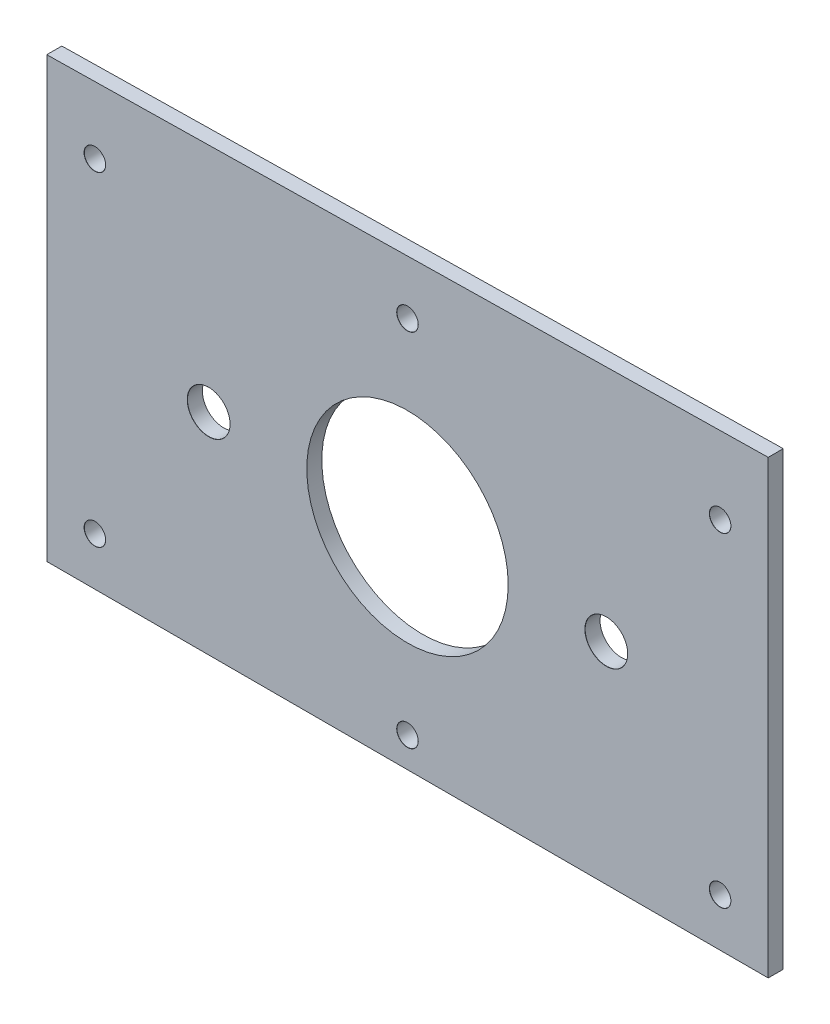
ISO-10303-21;
HEADER;
FILE_DESCRIPTION(('STEP AP214'),'2;1');
FILE_NAME('part.step','',(''),(''),'','','');
FILE_SCHEMA(('AUTOMOTIVE_DESIGN { 1 0 10303 214 1 1 1 1 }'));
ENDSEC;
DATA;
#1=APPLICATION_CONTEXT('core data for automotive mechanical design processes');
#2=APPLICATION_PROTOCOL_DEFINITION('international standard','automotive_design',2000,#1);
#3=PRODUCT_CONTEXT('',#1,'mechanical');
#4=PRODUCT('Part','Part','',(#3));
#5=PRODUCT_RELATED_PRODUCT_CATEGORY('part','',(#4));
#6=PRODUCT_DEFINITION_FORMATION('','',#4);
#7=PRODUCT_DEFINITION_CONTEXT('part definition',#1,'design');
#8=PRODUCT_DEFINITION('design','',#6,#7);
#9=PRODUCT_DEFINITION_SHAPE('','',#8);
#10=(LENGTH_UNIT() NAMED_UNIT(*) SI_UNIT(.MILLI.,.METRE.));
#11=(NAMED_UNIT(*) PLANE_ANGLE_UNIT() SI_UNIT($,.RADIAN.));
#12=(NAMED_UNIT(*) SI_UNIT($,.STERADIAN.) SOLID_ANGLE_UNIT());
#13=UNCERTAINTY_MEASURE_WITH_UNIT(LENGTH_MEASURE(1.E-05),#10,'distance_accuracy_value','');
#14=(GEOMETRIC_REPRESENTATION_CONTEXT(3) GLOBAL_UNCERTAINTY_ASSIGNED_CONTEXT((#13)) GLOBAL_UNIT_ASSIGNED_CONTEXT((#10,
#11,#12)) REPRESENTATION_CONTEXT('',''));
#15=CARTESIAN_POINT('',(0.,0.,0.));
#16=DIRECTION('',(0.,0.,1.));
#17=DIRECTION('',(1.,0.,0.));
#18=AXIS2_PLACEMENT_3D('',#15,#16,#17);
#19=CARTESIAN_POINT('',(76.2,44.45,3.175));
#20=DIRECTION('',(-1.,0.,0.));
#21=DIRECTION('',(0.,0.,1.));
#22=AXIS2_PLACEMENT_3D('',#19,#20,#21);
#23=PLANE('',#22);
#24=DIRECTION('',(0.,1.,0.));
#25=VECTOR('',#24,1.);
#26=CARTESIAN_POINT('',(76.2,44.45,0.));
#27=LINE('',#26,#25);
#28=CARTESIAN_POINT('',(76.2,-44.45,0.));
#29=VERTEX_POINT('',#28);
#30=CARTESIAN_POINT('',(76.2,50.8,0.));
#31=VERTEX_POINT('',#30);
#32=EDGE_CURVE('E80',#29,#31,#27,.T.);
#33=ORIENTED_EDGE('',*,*,#32,.T.);
#34=DIRECTION('',(0.,0.,-1.));
#35=VECTOR('',#34,1.);
#36=CARTESIAN_POINT('',(76.2,50.8,3.175));
#37=LINE('',#36,#35);
#38=CARTESIAN_POINT('',(76.2,50.8,3.175));
#39=VERTEX_POINT('',#38);
#40=EDGE_CURVE('E11',#39,#31,#37,.T.);
#41=ORIENTED_EDGE('',*,*,#40,.F.);
#42=DIRECTION('',(0.,1.,0.));
#43=VECTOR('',#42,1.);
#44=CARTESIAN_POINT('',(76.2,44.45,3.175));
#45=LINE('',#44,#43);
#46=CARTESIAN_POINT('',(76.2,-44.45,3.175));
#47=VERTEX_POINT('',#46);
#48=EDGE_CURVE('E85',#47,#39,#45,.T.);
#49=ORIENTED_EDGE('',*,*,#48,.F.);
#50=DIRECTION('',(0.,0.,-1.));
#51=VECTOR('',#50,1.);
#52=CARTESIAN_POINT('',(76.2,-44.45,3.175));
#53=LINE('',#52,#51);
#54=EDGE_CURVE('E101',#47,#29,#53,.T.);
#55=ORIENTED_EDGE('',*,*,#54,.T.);
#56=EDGE_LOOP('',(#33,#41,#49,#55));
#57=FACE_BOUND('',#56,.T.);
#58=ADVANCED_FACE('F41',(#57),#23,.F.);
#59=CARTESIAN_POINT('',(-76.2,48.26,3.175));
#60=DIRECTION('',(0.0166643523339933,-0.9998611400396,0.));
#61=DIRECTION('',(0.9998611400396,0.0166643523339933,0.));
#62=AXIS2_PLACEMENT_3D('',#59,#60,#61);
#63=PLANE('',#62);
#64=DIRECTION('',(-0.9998611400396,-0.0166643523339933,0.));
#65=VECTOR('',#64,1.);
#66=CARTESIAN_POINT('',(-76.2,48.26,0.));
#67=LINE('',#66,#65);
#68=CARTESIAN_POINT('',(-76.2,48.26,0.));
#69=VERTEX_POINT('',#68);
#70=EDGE_CURVE('E97',#31,#69,#67,.T.);
#71=ORIENTED_EDGE('',*,*,#70,.T.);
#72=DIRECTION('',(0.,0.,-1.));
#73=VECTOR('',#72,1.);
#74=CARTESIAN_POINT('',(-76.2,48.26,3.175));
#75=LINE('',#74,#73);
#76=CARTESIAN_POINT('',(-76.2,48.26,3.175));
#77=VERTEX_POINT('',#76);
#78=EDGE_CURVE('E49',#77,#69,#75,.T.);
#79=ORIENTED_EDGE('',*,*,#78,.F.);
#80=DIRECTION('',(-0.9998611400396,-0.0166643523339933,0.));
#81=VECTOR('',#80,1.);
#82=CARTESIAN_POINT('',(-76.2,48.26,3.175));
#83=LINE('',#82,#81);
#84=EDGE_CURVE('E88',#39,#77,#83,.T.);
#85=ORIENTED_EDGE('',*,*,#84,.F.);
#86=ORIENTED_EDGE('',*,*,#40,.T.);
#87=EDGE_LOOP('',(#71,#79,#85,#86));
#88=FACE_BOUND('',#87,.T.);
#89=ADVANCED_FACE('F96',(#88),#63,.F.);
#90=CARTESIAN_POINT('',(-76.2,44.45,3.175));
#91=DIRECTION('',(1.,0.,0.));
#92=DIRECTION('',(0.,0.,-1.));
#93=AXIS2_PLACEMENT_3D('',#90,#91,#92);
#94=PLANE('',#93);
#95=DIRECTION('',(0.,-1.,0.));
#96=VECTOR('',#95,1.);
#97=CARTESIAN_POINT('',(-76.2,44.45,0.));
#98=LINE('',#97,#96);
#99=CARTESIAN_POINT('',(-76.2,-44.45,0.));
#100=VERTEX_POINT('',#99);
#101=EDGE_CURVE('E73',#69,#100,#98,.T.);
#102=ORIENTED_EDGE('',*,*,#101,.T.);
#103=DIRECTION('',(0.,0.,-1.));
#104=VECTOR('',#103,1.);
#105=CARTESIAN_POINT('',(-76.2,-44.45,3.175));
#106=LINE('',#105,#104);
#107=CARTESIAN_POINT('',(-76.2,-44.45,3.175));
#108=VERTEX_POINT('',#107);
#109=EDGE_CURVE('E98',#108,#100,#106,.T.);
#110=ORIENTED_EDGE('',*,*,#109,.F.);
#111=DIRECTION('',(0.,-1.,0.));
#112=VECTOR('',#111,1.);
#113=CARTESIAN_POINT('',(-76.2,48.26,3.175));
#114=LINE('',#113,#112);
#115=EDGE_CURVE('E92',#77,#108,#114,.T.);
#116=ORIENTED_EDGE('',*,*,#115,.F.);
#117=ORIENTED_EDGE('',*,*,#78,.T.);
#118=EDGE_LOOP('',(#102,#110,#116,#117));
#119=FACE_BOUND('',#118,.T.);
#120=ADVANCED_FACE('F99',(#119),#94,.F.);
#121=CARTESIAN_POINT('',(-76.2,-44.45,3.175));
#122=DIRECTION('',(0.,1.,0.));
#123=DIRECTION('',(0.,0.,1.));
#124=AXIS2_PLACEMENT_3D('',#121,#122,#123);
#125=PLANE('',#124);
#126=DIRECTION('',(1.,0.,0.));
#127=VECTOR('',#126,1.);
#128=CARTESIAN_POINT('',(-76.2,-44.45,0.));
#129=LINE('',#128,#127);
#130=EDGE_CURVE('E109',#100,#29,#129,.T.);
#131=ORIENTED_EDGE('',*,*,#130,.T.);
#132=ORIENTED_EDGE('',*,*,#54,.F.);
#133=DIRECTION('',(1.,0.,0.));
#134=VECTOR('',#133,1.);
#135=CARTESIAN_POINT('',(-76.2,-44.45,3.175));
#136=LINE('',#135,#134);
#137=EDGE_CURVE('E57',#108,#47,#136,.T.);
#138=ORIENTED_EDGE('',*,*,#137,.F.);
#139=ORIENTED_EDGE('',*,*,#109,.T.);
#140=EDGE_LOOP('',(#131,#132,#138,#139));
#141=FACE_BOUND('',#140,.T.);
#142=ADVANCED_FACE('F114',(#141),#125,.F.);
#143=CARTESIAN_POINT('',(0.,0.,3.175));
#144=DIRECTION('',(0.,0.,1.));
#145=DIRECTION('',(1.,0.,0.));
#146=AXIS2_PLACEMENT_3D('',#143,#144,#145);
#147=PLANE('',#146);
#148=CARTESIAN_POINT('',(0.,0.,3.175));
#149=DIRECTION('',(0.,0.,1.));
#150=DIRECTION('',(1.,0.,0.));
#151=AXIS2_PLACEMENT_3D('',#148,#149,#150);
#152=CIRCLE('',#151,21.275);
#153=CARTESIAN_POINT('',(21.275,0.,3.175));
#154=VERTEX_POINT('',#153);
#155=EDGE_CURVE('E210',#154,#154,#152,.T.);
#156=ORIENTED_EDGE('',*,*,#155,.F.);
#157=EDGE_LOOP('',(#156));
#158=FACE_BOUND('',#157,.T.);
#159=CARTESIAN_POINT('',(-42.,0.,3.175));
#160=DIRECTION('',(0.,0.,1.));
#161=DIRECTION('',(1.,0.,0.));
#162=AXIS2_PLACEMENT_3D('',#159,#160,#161);
#163=CIRCLE('',#162,4.525);
#164=CARTESIAN_POINT('',(-37.475,0.,3.175));
#165=VERTEX_POINT('',#164);
#166=EDGE_CURVE('E206',#165,#165,#163,.T.);
#167=ORIENTED_EDGE('',*,*,#166,.F.);
#168=EDGE_LOOP('',(#167));
#169=FACE_BOUND('',#168,.T.);
#170=CARTESIAN_POINT('',(42.,0.,3.175));
#171=DIRECTION('',(0.,0.,1.));
#172=DIRECTION('',(1.,0.,0.));
#173=AXIS2_PLACEMENT_3D('',#170,#171,#172);
#174=CIRCLE('',#173,4.525);
#175=CARTESIAN_POINT('',(46.525,0.,3.175));
#176=VERTEX_POINT('',#175);
#177=EDGE_CURVE('E197',#176,#176,#174,.T.);
#178=ORIENTED_EDGE('',*,*,#177,.F.);
#179=EDGE_LOOP('',(#178));
#180=FACE_BOUND('',#179,.T.);
#181=CARTESIAN_POINT('',(-66.04,34.29,3.175));
#182=DIRECTION('',(0.,0.,1.));
#183=DIRECTION('',(1.,0.,0.));
#184=AXIS2_PLACEMENT_3D('',#181,#182,#183);
#185=CIRCLE('',#184,2.275);
#186=CARTESIAN_POINT('',(-63.765,34.29,3.175));
#187=VERTEX_POINT('',#186);
#188=EDGE_CURVE('E188',#187,#187,#185,.T.);
#189=ORIENTED_EDGE('',*,*,#188,.F.);
#190=EDGE_LOOP('',(#189));
#191=FACE_BOUND('',#190,.T.);
#192=CARTESIAN_POINT('',(-66.04,-34.29,3.175));
#193=DIRECTION('',(0.,0.,1.));
#194=DIRECTION('',(1.,0.,0.));
#195=AXIS2_PLACEMENT_3D('',#192,#193,#194);
#196=CIRCLE('',#195,2.275);
#197=CARTESIAN_POINT('',(-63.765,-34.29,3.175));
#198=VERTEX_POINT('',#197);
#199=EDGE_CURVE('E179',#198,#198,#196,.T.);
#200=ORIENTED_EDGE('',*,*,#199,.F.);
#201=EDGE_LOOP('',(#200));
#202=FACE_BOUND('',#201,.T.);
#203=CARTESIAN_POINT('',(0.,-38.1,3.175));
#204=DIRECTION('',(0.,0.,1.));
#205=DIRECTION('',(1.,0.,0.));
#206=AXIS2_PLACEMENT_3D('',#203,#204,#205);
#207=CIRCLE('',#206,2.275);
#208=CARTESIAN_POINT('',(2.27500000000003,-38.1,3.175));
#209=VERTEX_POINT('',#208);
#210=EDGE_CURVE('E170',#209,#209,#207,.T.);
#211=ORIENTED_EDGE('',*,*,#210,.F.);
#212=EDGE_LOOP('',(#211));
#213=FACE_BOUND('',#212,.T.);
#214=CARTESIAN_POINT('',(66.04,-34.29,3.175));
#215=DIRECTION('',(0.,0.,1.));
#216=DIRECTION('',(1.,0.,0.));
#217=AXIS2_PLACEMENT_3D('',#214,#215,#216);
#218=CIRCLE('',#217,2.275);
#219=CARTESIAN_POINT('',(68.315,-34.29,3.175));
#220=VERTEX_POINT('',#219);
#221=EDGE_CURVE('E161',#220,#220,#218,.T.);
#222=ORIENTED_EDGE('',*,*,#221,.F.);
#223=EDGE_LOOP('',(#222));
#224=FACE_BOUND('',#223,.T.);
#225=CARTESIAN_POINT('',(66.04,34.29,3.175));
#226=DIRECTION('',(0.,0.,1.));
#227=DIRECTION('',(1.,0.,0.));
#228=AXIS2_PLACEMENT_3D('',#225,#226,#227);
#229=CIRCLE('',#228,2.275);
#230=CARTESIAN_POINT('',(68.315,34.29,3.175));
#231=VERTEX_POINT('',#230);
#232=EDGE_CURVE('E152',#231,#231,#229,.T.);
#233=ORIENTED_EDGE('',*,*,#232,.F.);
#234=EDGE_LOOP('',(#233));
#235=FACE_BOUND('',#234,.T.);
#236=CARTESIAN_POINT('',(0.,38.1,3.175));
#237=DIRECTION('',(0.,0.,1.));
#238=DIRECTION('',(1.,0.,0.));
#239=AXIS2_PLACEMENT_3D('',#236,#237,#238);
#240=CIRCLE('',#239,2.275);
#241=CARTESIAN_POINT('',(2.27500000000003,38.1,3.175));
#242=VERTEX_POINT('',#241);
#243=EDGE_CURVE('E143',#242,#242,#240,.T.);
#244=ORIENTED_EDGE('',*,*,#243,.F.);
#245=EDGE_LOOP('',(#244));
#246=FACE_BOUND('',#245,.T.);
#247=ORIENTED_EDGE('',*,*,#48,.T.);
#248=ORIENTED_EDGE('',*,*,#84,.T.);
#249=ORIENTED_EDGE('',*,*,#115,.T.);
#250=ORIENTED_EDGE('',*,*,#137,.T.);
#251=EDGE_LOOP('',(#247,#248,#249,#250));
#252=FACE_BOUND('',#251,.T.);
#253=ADVANCED_FACE('F90',(#158,#169,#180,#191,#202,#213,#224,#235,#246,#252),#147,.T.);
#254=CARTESIAN_POINT('',(0.,0.,0.));
#255=DIRECTION('',(0.,0.,1.));
#256=DIRECTION('',(1.,0.,0.));
#257=AXIS2_PLACEMENT_3D('',#254,#255,#256);
#258=PLANE('',#257);
#259=CARTESIAN_POINT('',(0.,0.,0.));
#260=DIRECTION('',(0.,0.,1.));
#261=DIRECTION('',(1.,0.,0.));
#262=AXIS2_PLACEMENT_3D('',#259,#260,#261);
#263=CIRCLE('',#262,21.275);
#264=CARTESIAN_POINT('',(21.275,0.,0.));
#265=VERTEX_POINT('',#264);
#266=EDGE_CURVE('E209',#265,#265,#263,.T.);
#267=ORIENTED_EDGE('',*,*,#266,.T.);
#268=EDGE_LOOP('',(#267));
#269=FACE_BOUND('',#268,.T.);
#270=CARTESIAN_POINT('',(-42.,0.,0.));
#271=DIRECTION('',(0.,0.,1.));
#272=DIRECTION('',(1.,0.,0.));
#273=AXIS2_PLACEMENT_3D('',#270,#271,#272);
#274=CIRCLE('',#273,4.5);
#275=CARTESIAN_POINT('',(-37.5,0.,0.));
#276=VERTEX_POINT('',#275);
#277=EDGE_CURVE('E200',#276,#276,#274,.T.);
#278=ORIENTED_EDGE('',*,*,#277,.T.);
#279=EDGE_LOOP('',(#278));
#280=FACE_BOUND('',#279,.T.);
#281=CARTESIAN_POINT('',(42.,0.,0.));
#282=DIRECTION('',(0.,0.,1.));
#283=DIRECTION('',(1.,0.,0.));
#284=AXIS2_PLACEMENT_3D('',#281,#282,#283);
#285=CIRCLE('',#284,4.5);
#286=CARTESIAN_POINT('',(46.5,0.,0.));
#287=VERTEX_POINT('',#286);
#288=EDGE_CURVE('E191',#287,#287,#285,.T.);
#289=ORIENTED_EDGE('',*,*,#288,.T.);
#290=EDGE_LOOP('',(#289));
#291=FACE_BOUND('',#290,.T.);
#292=CARTESIAN_POINT('',(-66.04,34.29,0.));
#293=DIRECTION('',(0.,0.,1.));
#294=DIRECTION('',(1.,0.,0.));
#295=AXIS2_PLACEMENT_3D('',#292,#293,#294);
#296=CIRCLE('',#295,2.25);
#297=CARTESIAN_POINT('',(-63.79,34.29,0.));
#298=VERTEX_POINT('',#297);
#299=EDGE_CURVE('E182',#298,#298,#296,.T.);
#300=ORIENTED_EDGE('',*,*,#299,.T.);
#301=EDGE_LOOP('',(#300));
#302=FACE_BOUND('',#301,.T.);
#303=CARTESIAN_POINT('',(-66.04,-34.29,0.));
#304=DIRECTION('',(0.,0.,1.));
#305=DIRECTION('',(1.,0.,0.));
#306=AXIS2_PLACEMENT_3D('',#303,#304,#305);
#307=CIRCLE('',#306,2.25);
#308=CARTESIAN_POINT('',(-63.79,-34.29,0.));
#309=VERTEX_POINT('',#308);
#310=EDGE_CURVE('E173',#309,#309,#307,.T.);
#311=ORIENTED_EDGE('',*,*,#310,.T.);
#312=EDGE_LOOP('',(#311));
#313=FACE_BOUND('',#312,.T.);
#314=CARTESIAN_POINT('',(0.,-38.1,0.));
#315=DIRECTION('',(0.,0.,1.));
#316=DIRECTION('',(1.,0.,0.));
#317=AXIS2_PLACEMENT_3D('',#314,#315,#316);
#318=CIRCLE('',#317,2.25);
#319=CARTESIAN_POINT('',(2.25000000000003,-38.1,0.));
#320=VERTEX_POINT('',#319);
#321=EDGE_CURVE('E164',#320,#320,#318,.T.);
#322=ORIENTED_EDGE('',*,*,#321,.T.);
#323=EDGE_LOOP('',(#322));
#324=FACE_BOUND('',#323,.T.);
#325=CARTESIAN_POINT('',(66.04,-34.29,0.));
#326=DIRECTION('',(0.,0.,1.));
#327=DIRECTION('',(1.,0.,0.));
#328=AXIS2_PLACEMENT_3D('',#325,#326,#327);
#329=CIRCLE('',#328,2.25);
#330=CARTESIAN_POINT('',(68.29,-34.29,0.));
#331=VERTEX_POINT('',#330);
#332=EDGE_CURVE('E155',#331,#331,#329,.T.);
#333=ORIENTED_EDGE('',*,*,#332,.T.);
#334=EDGE_LOOP('',(#333));
#335=FACE_BOUND('',#334,.T.);
#336=CARTESIAN_POINT('',(66.04,34.29,0.));
#337=DIRECTION('',(0.,0.,1.));
#338=DIRECTION('',(1.,0.,0.));
#339=AXIS2_PLACEMENT_3D('',#336,#337,#338);
#340=CIRCLE('',#339,2.25);
#341=CARTESIAN_POINT('',(68.29,34.29,0.));
#342=VERTEX_POINT('',#341);
#343=EDGE_CURVE('E146',#342,#342,#340,.T.);
#344=ORIENTED_EDGE('',*,*,#343,.T.);
#345=EDGE_LOOP('',(#344));
#346=FACE_BOUND('',#345,.T.);
#347=CARTESIAN_POINT('',(0.,38.1,0.));
#348=DIRECTION('',(0.,0.,1.));
#349=DIRECTION('',(1.,0.,0.));
#350=AXIS2_PLACEMENT_3D('',#347,#348,#349);
#351=CIRCLE('',#350,2.25);
#352=CARTESIAN_POINT('',(2.25000000000003,38.1,0.));
#353=VERTEX_POINT('',#352);
#354=EDGE_CURVE('E106',#353,#353,#351,.T.);
#355=ORIENTED_EDGE('',*,*,#354,.T.);
#356=EDGE_LOOP('',(#355));
#357=FACE_BOUND('',#356,.T.);
#358=ORIENTED_EDGE('',*,*,#32,.F.);
#359=ORIENTED_EDGE('',*,*,#130,.F.);
#360=ORIENTED_EDGE('',*,*,#101,.F.);
#361=ORIENTED_EDGE('',*,*,#70,.F.);
#362=EDGE_LOOP('',(#358,#359,#360,#361));
#363=FACE_BOUND('',#362,.T.);
#364=ADVANCED_FACE('F115',(#269,#280,#291,#302,#313,#324,#335,#346,#357,#363),#258,.F.);
#365=CARTESIAN_POINT('',(0.,38.1,3.175));
#366=DIRECTION('',(0.,0.,1.));
#367=DIRECTION('',(1.,0.,0.));
#368=AXIS2_PLACEMENT_3D('',#365,#366,#367);
#369=CYLINDRICAL_SURFACE('',#368,2.25);
#370=ORIENTED_EDGE('',*,*,#354,.F.);
#371=EDGE_LOOP('',(#370));
#372=FACE_BOUND('',#371,.T.);
#373=CARTESIAN_POINT('',(0.,38.1,3.15));
#374=DIRECTION('',(0.,0.,1.));
#375=DIRECTION('',(1.,0.,0.));
#376=AXIS2_PLACEMENT_3D('',#373,#374,#375);
#377=CIRCLE('',#376,2.25);
#378=CARTESIAN_POINT('',(2.25000000000003,38.1,3.15));
#379=VERTEX_POINT('',#378);
#380=EDGE_CURVE('E140',#379,#379,#377,.T.);
#381=ORIENTED_EDGE('',*,*,#380,.T.);
#382=EDGE_LOOP('',(#381));
#383=FACE_BOUND('',#382,.T.);
#384=ADVANCED_FACE('F117',(#372,#383),#369,.F.);
#385=CARTESIAN_POINT('',(0.,38.1,3.175));
#386=DIRECTION('',(0.,0.,1.));
#387=DIRECTION('',(1.,0.,0.));
#388=AXIS2_PLACEMENT_3D('',#385,#386,#387);
#389=CONICAL_SURFACE('',#388,2.275,0.785398163397396);
#390=ORIENTED_EDGE('',*,*,#380,.F.);
#391=EDGE_LOOP('',(#390));
#392=FACE_BOUND('',#391,.T.);
#393=ORIENTED_EDGE('',*,*,#243,.T.);
#394=EDGE_LOOP('',(#393));
#395=FACE_BOUND('',#394,.T.);
#396=ADVANCED_FACE('F124',(#392,#395),#389,.F.);
#397=CARTESIAN_POINT('',(66.04,34.29,3.175));
#398=DIRECTION('',(0.,0.,1.));
#399=DIRECTION('',(1.,0.,0.));
#400=AXIS2_PLACEMENT_3D('',#397,#398,#399);
#401=CYLINDRICAL_SURFACE('',#400,2.25);
#402=ORIENTED_EDGE('',*,*,#343,.F.);
#403=EDGE_LOOP('',(#402));
#404=FACE_BOUND('',#403,.T.);
#405=CARTESIAN_POINT('',(66.04,34.29,3.15));
#406=DIRECTION('',(0.,0.,1.));
#407=DIRECTION('',(1.,0.,0.));
#408=AXIS2_PLACEMENT_3D('',#405,#406,#407);
#409=CIRCLE('',#408,2.25);
#410=CARTESIAN_POINT('',(68.29,34.29,3.15));
#411=VERTEX_POINT('',#410);
#412=EDGE_CURVE('E149',#411,#411,#409,.T.);
#413=ORIENTED_EDGE('',*,*,#412,.T.);
#414=EDGE_LOOP('',(#413));
#415=FACE_BOUND('',#414,.T.);
#416=ADVANCED_FACE('F239',(#404,#415),#401,.F.);
#417=CARTESIAN_POINT('',(66.04,34.29,3.175));
#418=DIRECTION('',(0.,0.,1.));
#419=DIRECTION('',(1.,0.,0.));
#420=AXIS2_PLACEMENT_3D('',#417,#418,#419);
#421=CONICAL_SURFACE('',#420,2.275,0.785398163397353);
#422=ORIENTED_EDGE('',*,*,#412,.F.);
#423=EDGE_LOOP('',(#422));
#424=FACE_BOUND('',#423,.T.);
#425=ORIENTED_EDGE('',*,*,#232,.T.);
#426=EDGE_LOOP('',(#425));
#427=FACE_BOUND('',#426,.T.);
#428=ADVANCED_FACE('F245',(#424,#427),#421,.F.);
#429=CARTESIAN_POINT('',(66.04,-34.29,3.175));
#430=DIRECTION('',(0.,0.,1.));
#431=DIRECTION('',(1.,0.,0.));
#432=AXIS2_PLACEMENT_3D('',#429,#430,#431);
#433=CYLINDRICAL_SURFACE('',#432,2.25);
#434=ORIENTED_EDGE('',*,*,#332,.F.);
#435=EDGE_LOOP('',(#434));
#436=FACE_BOUND('',#435,.T.);
#437=CARTESIAN_POINT('',(66.04,-34.29,3.15));
#438=DIRECTION('',(0.,0.,1.));
#439=DIRECTION('',(1.,0.,0.));
#440=AXIS2_PLACEMENT_3D('',#437,#438,#439);
#441=CIRCLE('',#440,2.25);
#442=CARTESIAN_POINT('',(68.29,-34.29,3.15));
#443=VERTEX_POINT('',#442);
#444=EDGE_CURVE('E158',#443,#443,#441,.T.);
#445=ORIENTED_EDGE('',*,*,#444,.T.);
#446=EDGE_LOOP('',(#445));
#447=FACE_BOUND('',#446,.T.);
#448=ADVANCED_FACE('F252',(#436,#447),#433,.F.);
#449=CARTESIAN_POINT('',(66.04,-34.29,3.175));
#450=DIRECTION('',(0.,0.,1.));
#451=DIRECTION('',(1.,0.,0.));
#452=AXIS2_PLACEMENT_3D('',#449,#450,#451);
#453=CONICAL_SURFACE('',#452,2.275,0.785398163397353);
#454=ORIENTED_EDGE('',*,*,#444,.F.);
#455=EDGE_LOOP('',(#454));
#456=FACE_BOUND('',#455,.T.);
#457=ORIENTED_EDGE('',*,*,#221,.T.);
#458=EDGE_LOOP('',(#457));
#459=FACE_BOUND('',#458,.T.);
#460=ADVANCED_FACE('F256',(#456,#459),#453,.F.);
#461=CARTESIAN_POINT('',(0.,-38.1,3.175));
#462=DIRECTION('',(0.,0.,1.));
#463=DIRECTION('',(1.,0.,0.));
#464=AXIS2_PLACEMENT_3D('',#461,#462,#463);
#465=CYLINDRICAL_SURFACE('',#464,2.25);
#466=ORIENTED_EDGE('',*,*,#321,.F.);
#467=EDGE_LOOP('',(#466));
#468=FACE_BOUND('',#467,.T.);
#469=CARTESIAN_POINT('',(0.,-38.1,3.15));
#470=DIRECTION('',(0.,0.,1.));
#471=DIRECTION('',(1.,0.,0.));
#472=AXIS2_PLACEMENT_3D('',#469,#470,#471);
#473=CIRCLE('',#472,2.25);
#474=CARTESIAN_POINT('',(2.25000000000003,-38.1,3.15));
#475=VERTEX_POINT('',#474);
#476=EDGE_CURVE('E167',#475,#475,#473,.T.);
#477=ORIENTED_EDGE('',*,*,#476,.T.);
#478=EDGE_LOOP('',(#477));
#479=FACE_BOUND('',#478,.T.);
#480=ADVANCED_FACE('F260',(#468,#479),#465,.F.);
#481=CARTESIAN_POINT('',(0.,-38.1,3.175));
#482=DIRECTION('',(0.,0.,1.));
#483=DIRECTION('',(1.,0.,0.));
#484=AXIS2_PLACEMENT_3D('',#481,#482,#483);
#485=CONICAL_SURFACE('',#484,2.275,0.785398163397396);
#486=ORIENTED_EDGE('',*,*,#476,.F.);
#487=EDGE_LOOP('',(#486));
#488=FACE_BOUND('',#487,.T.);
#489=ORIENTED_EDGE('',*,*,#210,.T.);
#490=EDGE_LOOP('',(#489));
#491=FACE_BOUND('',#490,.T.);
#492=ADVANCED_FACE('F264',(#488,#491),#485,.F.);
#493=CARTESIAN_POINT('',(-66.04,-34.29,3.175));
#494=DIRECTION('',(0.,0.,1.));
#495=DIRECTION('',(1.,0.,0.));
#496=AXIS2_PLACEMENT_3D('',#493,#494,#495);
#497=CYLINDRICAL_SURFACE('',#496,2.25);
#498=ORIENTED_EDGE('',*,*,#310,.F.);
#499=EDGE_LOOP('',(#498));
#500=FACE_BOUND('',#499,.T.);
#501=CARTESIAN_POINT('',(-66.04,-34.29,3.15));
#502=DIRECTION('',(0.,0.,1.));
#503=DIRECTION('',(1.,0.,0.));
#504=AXIS2_PLACEMENT_3D('',#501,#502,#503);
#505=CIRCLE('',#504,2.25);
#506=CARTESIAN_POINT('',(-63.79,-34.29,3.15));
#507=VERTEX_POINT('',#506);
#508=EDGE_CURVE('E176',#507,#507,#505,.T.);
#509=ORIENTED_EDGE('',*,*,#508,.T.);
#510=EDGE_LOOP('',(#509));
#511=FACE_BOUND('',#510,.T.);
#512=ADVANCED_FACE('F268',(#500,#511),#497,.F.);
#513=CARTESIAN_POINT('',(-66.04,-34.29,3.175));
#514=DIRECTION('',(0.,0.,1.));
#515=DIRECTION('',(1.,0.,0.));
#516=AXIS2_PLACEMENT_3D('',#513,#514,#515);
#517=CONICAL_SURFACE('',#516,2.275,0.785398163397353);
#518=ORIENTED_EDGE('',*,*,#508,.F.);
#519=EDGE_LOOP('',(#518));
#520=FACE_BOUND('',#519,.T.);
#521=ORIENTED_EDGE('',*,*,#199,.T.);
#522=EDGE_LOOP('',(#521));
#523=FACE_BOUND('',#522,.T.);
#524=ADVANCED_FACE('F272',(#520,#523),#517,.F.);
#525=CARTESIAN_POINT('',(-66.04,34.29,3.175));
#526=DIRECTION('',(0.,0.,1.));
#527=DIRECTION('',(1.,0.,0.));
#528=AXIS2_PLACEMENT_3D('',#525,#526,#527);
#529=CYLINDRICAL_SURFACE('',#528,2.25);
#530=ORIENTED_EDGE('',*,*,#299,.F.);
#531=EDGE_LOOP('',(#530));
#532=FACE_BOUND('',#531,.T.);
#533=CARTESIAN_POINT('',(-66.04,34.29,3.15));
#534=DIRECTION('',(0.,0.,1.));
#535=DIRECTION('',(1.,0.,0.));
#536=AXIS2_PLACEMENT_3D('',#533,#534,#535);
#537=CIRCLE('',#536,2.25);
#538=CARTESIAN_POINT('',(-63.79,34.29,3.15));
#539=VERTEX_POINT('',#538);
#540=EDGE_CURVE('E185',#539,#539,#537,.T.);
#541=ORIENTED_EDGE('',*,*,#540,.T.);
#542=EDGE_LOOP('',(#541));
#543=FACE_BOUND('',#542,.T.);
#544=ADVANCED_FACE('F276',(#532,#543),#529,.F.);
#545=CARTESIAN_POINT('',(-66.04,34.29,3.175));
#546=DIRECTION('',(0.,0.,1.));
#547=DIRECTION('',(1.,0.,0.));
#548=AXIS2_PLACEMENT_3D('',#545,#546,#547);
#549=CONICAL_SURFACE('',#548,2.275,0.785398163397353);
#550=ORIENTED_EDGE('',*,*,#540,.F.);
#551=EDGE_LOOP('',(#550));
#552=FACE_BOUND('',#551,.T.);
#553=ORIENTED_EDGE('',*,*,#188,.T.);
#554=EDGE_LOOP('',(#553));
#555=FACE_BOUND('',#554,.T.);
#556=ADVANCED_FACE('F280',(#552,#555),#549,.F.);
#557=CARTESIAN_POINT('',(42.,0.,3.175));
#558=DIRECTION('',(0.,0.,1.));
#559=DIRECTION('',(1.,0.,0.));
#560=AXIS2_PLACEMENT_3D('',#557,#558,#559);
#561=CYLINDRICAL_SURFACE('',#560,4.5);
#562=ORIENTED_EDGE('',*,*,#288,.F.);
#563=EDGE_LOOP('',(#562));
#564=FACE_BOUND('',#563,.T.);
#565=CARTESIAN_POINT('',(42.,0.,3.15));
#566=DIRECTION('',(0.,0.,1.));
#567=DIRECTION('',(1.,0.,0.));
#568=AXIS2_PLACEMENT_3D('',#565,#566,#567);
#569=CIRCLE('',#568,4.5);
#570=CARTESIAN_POINT('',(46.5,0.,3.15));
#571=VERTEX_POINT('',#570);
#572=EDGE_CURVE('E194',#571,#571,#569,.T.);
#573=ORIENTED_EDGE('',*,*,#572,.T.);
#574=EDGE_LOOP('',(#573));
#575=FACE_BOUND('',#574,.T.);
#576=ADVANCED_FACE('F284',(#564,#575),#561,.F.);
#577=CARTESIAN_POINT('',(42.,0.,3.175));
#578=DIRECTION('',(0.,0.,1.));
#579=DIRECTION('',(1.,0.,0.));
#580=AXIS2_PLACEMENT_3D('',#577,#578,#579);
#581=CONICAL_SURFACE('',#580,4.525,0.7853981633975);
#582=ORIENTED_EDGE('',*,*,#572,.F.);
#583=EDGE_LOOP('',(#582));
#584=FACE_BOUND('',#583,.T.);
#585=ORIENTED_EDGE('',*,*,#177,.T.);
#586=EDGE_LOOP('',(#585));
#587=FACE_BOUND('',#586,.T.);
#588=ADVANCED_FACE('F288',(#584,#587),#581,.F.);
#589=CARTESIAN_POINT('',(-42.,0.,3.175));
#590=DIRECTION('',(0.,0.,1.));
#591=DIRECTION('',(1.,0.,0.));
#592=AXIS2_PLACEMENT_3D('',#589,#590,#591);
#593=CYLINDRICAL_SURFACE('',#592,4.5);
#594=ORIENTED_EDGE('',*,*,#277,.F.);
#595=EDGE_LOOP('',(#594));
#596=FACE_BOUND('',#595,.T.);
#597=CARTESIAN_POINT('',(-42.,0.,3.15));
#598=DIRECTION('',(0.,0.,1.));
#599=DIRECTION('',(1.,0.,0.));
#600=AXIS2_PLACEMENT_3D('',#597,#598,#599);
#601=CIRCLE('',#600,4.5);
#602=CARTESIAN_POINT('',(-37.5,0.,3.15));
#603=VERTEX_POINT('',#602);
#604=EDGE_CURVE('E203',#603,#603,#601,.T.);
#605=ORIENTED_EDGE('',*,*,#604,.T.);
#606=EDGE_LOOP('',(#605));
#607=FACE_BOUND('',#606,.T.);
#608=ADVANCED_FACE('F292',(#596,#607),#593,.F.);
#609=CARTESIAN_POINT('',(-42.,0.,3.175));
#610=DIRECTION('',(0.,0.,1.));
#611=DIRECTION('',(1.,0.,0.));
#612=AXIS2_PLACEMENT_3D('',#609,#610,#611);
#613=CONICAL_SURFACE('',#612,4.525,0.7853981633975);
#614=ORIENTED_EDGE('',*,*,#604,.F.);
#615=EDGE_LOOP('',(#614));
#616=FACE_BOUND('',#615,.T.);
#617=ORIENTED_EDGE('',*,*,#166,.T.);
#618=EDGE_LOOP('',(#617));
#619=FACE_BOUND('',#618,.T.);
#620=ADVANCED_FACE('F218',(#616,#619),#613,.F.);
#621=CARTESIAN_POINT('',(0.,0.,0.));
#622=DIRECTION('',(0.,0.,1.));
#623=DIRECTION('',(1.,0.,0.));
#624=AXIS2_PLACEMENT_3D('',#621,#622,#623);
#625=CYLINDRICAL_SURFACE('',#624,21.275);
#626=ORIENTED_EDGE('',*,*,#266,.F.);
#627=EDGE_LOOP('',(#626));
#628=FACE_BOUND('',#627,.T.);
#629=ORIENTED_EDGE('',*,*,#155,.T.);
#630=EDGE_LOOP('',(#629));
#631=FACE_BOUND('',#630,.T.);
#632=ADVANCED_FACE('F215',(#628,#631),#625,.F.);
#633=CLOSED_SHELL('',(#58,#89,#120,#142,#253,#364,#384,#396,#416,#428,#448,#460,#480,#492,#512,
#524,#544,#556,#576,#588,#608,#620,#632));
#634=MANIFOLD_SOLID_BREP('B2',#633);
#635=ADVANCED_BREP_SHAPE_REPRESENTATION('',(#18,#634),#14);
#636=SHAPE_DEFINITION_REPRESENTATION(#9,#635);
ENDSEC;
END-ISO-10303-21;
